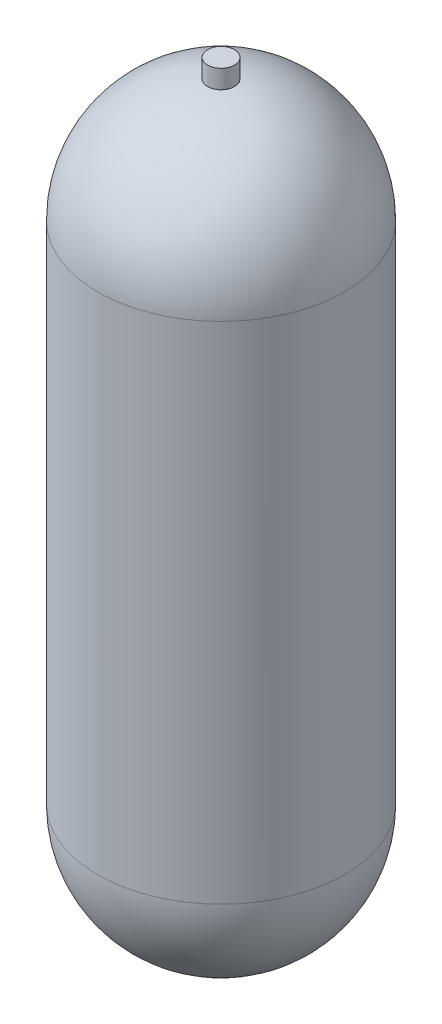
ISO-10303-21;
HEADER;
FILE_DESCRIPTION(('STEP AP214'),'2;1');
FILE_NAME('part.step','',(''),(''),'','','');
FILE_SCHEMA(('AUTOMOTIVE_DESIGN { 1 0 10303 214 1 1 1 1 }'));
ENDSEC;
DATA;
#1=APPLICATION_CONTEXT('core data for automotive mechanical design processes');
#2=APPLICATION_PROTOCOL_DEFINITION('international standard','automotive_design',2000,#1);
#3=PRODUCT_CONTEXT('',#1,'mechanical');
#4=PRODUCT('Part','Part','',(#3));
#5=PRODUCT_RELATED_PRODUCT_CATEGORY('part','',(#4));
#6=PRODUCT_DEFINITION_FORMATION('','',#4);
#7=PRODUCT_DEFINITION_CONTEXT('part definition',#1,'design');
#8=PRODUCT_DEFINITION('design','',#6,#7);
#9=PRODUCT_DEFINITION_SHAPE('','',#8);
#10=(LENGTH_UNIT() NAMED_UNIT(*) SI_UNIT(.MILLI.,.METRE.));
#11=(NAMED_UNIT(*) PLANE_ANGLE_UNIT() SI_UNIT($,.RADIAN.));
#12=(NAMED_UNIT(*) SI_UNIT($,.STERADIAN.) SOLID_ANGLE_UNIT());
#13=UNCERTAINTY_MEASURE_WITH_UNIT(LENGTH_MEASURE(1.E-05),#10,'distance_accuracy_value','');
#14=(GEOMETRIC_REPRESENTATION_CONTEXT(3) GLOBAL_UNCERTAINTY_ASSIGNED_CONTEXT((#13)) GLOBAL_UNIT_ASSIGNED_CONTEXT((#10,
#11,#12)) REPRESENTATION_CONTEXT('',''));
#15=CARTESIAN_POINT('',(0.,0.,0.));
#16=DIRECTION('',(0.,0.,1.));
#17=DIRECTION('',(1.,0.,0.));
#18=AXIS2_PLACEMENT_3D('',#15,#16,#17);
#19=CARTESIAN_POINT('',(0.,445.77,0.));
#20=DIRECTION('',(0.,-1.,0.));
#21=DIRECTION('',(1.,0.,0.));
#22=AXIS2_PLACEMENT_3D('',#19,#20,#21);
#23=SPHERICAL_SURFACE('',#22,87.63);
#24=CARTESIAN_POINT('',(0.,532.880798842491,0.));
#25=DIRECTION('',(0.,-1.,0.));
#26=DIRECTION('',(0.,0.,-1.));
#27=AXIS2_PLACEMENT_3D('',#24,#25,#26);
#28=CIRCLE('',#27,9.525);
#29=CARTESIAN_POINT('',(0.,532.880798842491,-9.525));
#30=VERTEX_POINT('',#29);
#31=EDGE_CURVE('E10',#30,#30,#28,.F.);
#32=ORIENTED_EDGE('',*,*,#31,.F.);
#33=EDGE_LOOP('',(#32));
#34=FACE_BOUND('',#33,.T.);
#35=CARTESIAN_POINT('',(0.,445.77,0.));
#36=DIRECTION('',(0.,-1.,0.));
#37=DIRECTION('',(0.,0.,-1.));
#38=AXIS2_PLACEMENT_3D('',#35,#36,#37);
#39=CIRCLE('',#38,87.63);
#40=CARTESIAN_POINT('',(0.,445.77,-87.63));
#41=VERTEX_POINT('',#40);
#42=EDGE_CURVE('E51',#41,#41,#39,.T.);
#43=ORIENTED_EDGE('',*,*,#42,.F.);
#44=EDGE_LOOP('',(#43));
#45=FACE_BOUND('',#44,.T.);
#46=ADVANCED_FACE('F31',(#34,#45),#23,.T.);
#47=CARTESIAN_POINT('',(0.,87.63,0.));
#48=DIRECTION('',(0.,-1.,0.));
#49=DIRECTION('',(-1.,0.,0.));
#50=AXIS2_PLACEMENT_3D('',#47,#48,#49);
#51=SPHERICAL_SURFACE('',#50,87.63);
#52=CARTESIAN_POINT('',(0.,87.63,0.));
#53=DIRECTION('',(0.,-1.,0.));
#54=DIRECTION('',(0.,0.,-1.));
#55=AXIS2_PLACEMENT_3D('',#52,#53,#54);
#56=CIRCLE('',#55,87.63);
#57=CARTESIAN_POINT('',(0.,87.63,-87.63));
#58=VERTEX_POINT('',#57);
#59=EDGE_CURVE('E46',#58,#58,#56,.T.);
#60=ORIENTED_EDGE('',*,*,#59,.T.);
#61=EDGE_LOOP('',(#60));
#62=FACE_BOUND('',#61,.T.);
#63=ADVANCED_FACE('F69',(#62),#51,.T.);
#64=CARTESIAN_POINT('',(0.,533.4,0.));
#65=DIRECTION('',(0.,-1.,0.));
#66=DIRECTION('',(0.,0.,-1.));
#67=AXIS2_PLACEMENT_3D('',#64,#65,#66);
#68=CYLINDRICAL_SURFACE('',#67,87.63);
#69=ORIENTED_EDGE('',*,*,#42,.T.);
#70=EDGE_LOOP('',(#69));
#71=FACE_BOUND('',#70,.T.);
#72=ORIENTED_EDGE('',*,*,#59,.F.);
#73=EDGE_LOOP('',(#72));
#74=FACE_BOUND('',#73,.T.);
#75=ADVANCED_FACE('F62',(#71,#74),#68,.T.);
#76=CARTESIAN_POINT('',(0.,-500000.,0.));
#77=DIRECTION('',(0.,1.,0.));
#78=DIRECTION('',(0.,0.,1.));
#79=AXIS2_PLACEMENT_3D('',#76,#77,#78);
#80=CYLINDRICAL_SURFACE('',#79,9.525);
#81=ORIENTED_EDGE('',*,*,#31,.T.);
#82=EDGE_LOOP('',(#81));
#83=FACE_BOUND('',#82,.T.);
#84=CARTESIAN_POINT('',(0.,546.1,0.));
#85=DIRECTION('',(0.,1.,0.));
#86=DIRECTION('',(0.,0.,1.));
#87=AXIS2_PLACEMENT_3D('',#84,#85,#86);
#88=CIRCLE('',#87,9.525);
#89=CARTESIAN_POINT('',(0.,546.1,9.525));
#90=VERTEX_POINT('',#89);
#91=EDGE_CURVE('E54',#90,#90,#88,.T.);
#92=ORIENTED_EDGE('',*,*,#91,.F.);
#93=EDGE_LOOP('',(#92));
#94=FACE_BOUND('',#93,.T.);
#95=ADVANCED_FACE('F60',(#83,#94),#80,.T.);
#96=CARTESIAN_POINT('',(0.,546.1,0.));
#97=DIRECTION('',(0.,1.,0.));
#98=DIRECTION('',(0.,0.,1.));
#99=AXIS2_PLACEMENT_3D('',#96,#97,#98);
#100=PLANE('',#99);
#101=ORIENTED_EDGE('',*,*,#91,.T.);
#102=EDGE_LOOP('',(#101));
#103=FACE_BOUND('',#102,.T.);
#104=ADVANCED_FACE('F58',(#103),#100,.T.);
#105=CLOSED_SHELL('',(#46,#63,#75,#95,#104));
#106=CARTESIAN_POINT('',(0.,445.77,0.));
#107=DIRECTION('',(0.,-1.,0.));
#108=DIRECTION('',(1.,0.,0.));
#109=AXIS2_PLACEMENT_3D('',#106,#107,#108);
#110=SPHERICAL_SURFACE('',#109,84.455);
#111=CARTESIAN_POINT('',(0.,445.77,0.));
#112=DIRECTION('',(0.,-1.,0.));
#113=DIRECTION('',(0.,0.,-1.));
#114=AXIS2_PLACEMENT_3D('',#111,#112,#113);
#115=CIRCLE('',#114,84.455);
#116=CARTESIAN_POINT('',(0.,445.77,-84.455));
#117=VERTEX_POINT('',#116);
#118=EDGE_CURVE('E38',#117,#117,#115,.T.);
#119=ORIENTED_EDGE('',*,*,#118,.T.);
#120=EDGE_LOOP('',(#119));
#121=FACE_BOUND('',#120,.T.);
#122=ADVANCED_FACE('F93',(#121),#110,.F.);
#123=CARTESIAN_POINT('',(0.,533.4,0.));
#124=DIRECTION('',(0.,-1.,0.));
#125=DIRECTION('',(0.,0.,-1.));
#126=AXIS2_PLACEMENT_3D('',#123,#124,#125);
#127=CYLINDRICAL_SURFACE('',#126,84.455);
#128=CARTESIAN_POINT('',(0.,87.63,0.));
#129=DIRECTION('',(0.,-1.,0.));
#130=DIRECTION('',(0.,0.,-1.));
#131=AXIS2_PLACEMENT_3D('',#128,#129,#130);
#132=CIRCLE('',#131,84.455);
#133=CARTESIAN_POINT('',(0.,87.63,-84.455));
#134=VERTEX_POINT('',#133);
#135=EDGE_CURVE('E42',#134,#134,#132,.T.);
#136=ORIENTED_EDGE('',*,*,#135,.T.);
#137=EDGE_LOOP('',(#136));
#138=FACE_BOUND('',#137,.T.);
#139=ORIENTED_EDGE('',*,*,#118,.F.);
#140=EDGE_LOOP('',(#139));
#141=FACE_BOUND('',#140,.T.);
#142=ADVANCED_FACE('F89',(#138,#141),#127,.F.);
#143=CARTESIAN_POINT('',(0.,87.63,0.));
#144=DIRECTION('',(0.,-1.,0.));
#145=DIRECTION('',(1.,0.,0.));
#146=AXIS2_PLACEMENT_3D('',#143,#144,#145);
#147=SPHERICAL_SURFACE('',#146,84.455);
#148=ORIENTED_EDGE('',*,*,#135,.F.);
#149=EDGE_LOOP('',(#148));
#150=FACE_BOUND('',#149,.T.);
#151=ADVANCED_FACE('F86',(#150),#147,.F.);
#152=CLOSED_SHELL('',(#122,#142,#151));
#153=ORIENTED_CLOSED_SHELL('',*,#152,.T.);
#154=BREP_WITH_VOIDS('B2',#105,(#153));
#155=ADVANCED_BREP_SHAPE_REPRESENTATION('',(#18,#154),#14);
#156=SHAPE_DEFINITION_REPRESENTATION(#9,#155);
ENDSEC;
END-ISO-10303-21;
